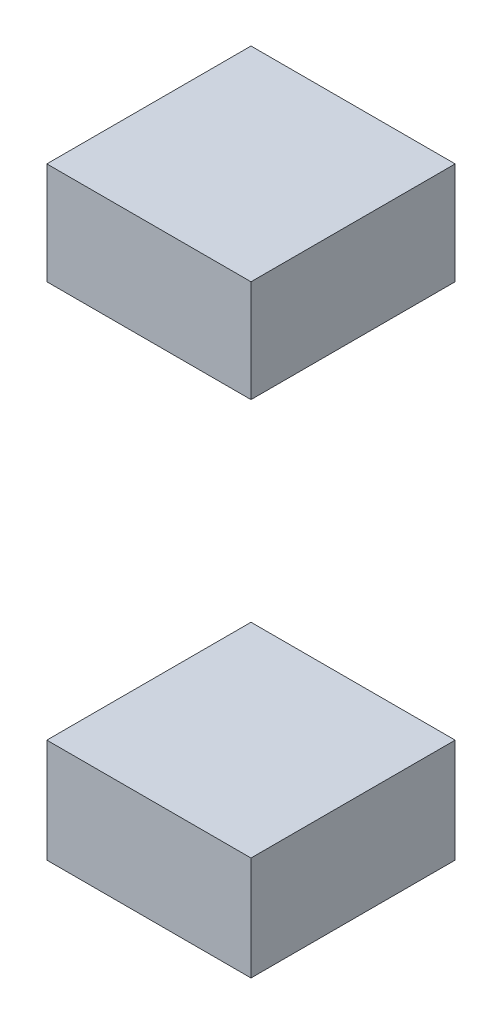
ISO-10303-21;
HEADER;
FILE_DESCRIPTION(('STEP AP214'),'2;1');
FILE_NAME('part.step','',(''),(''),'','','');
FILE_SCHEMA(('AUTOMOTIVE_DESIGN { 1 0 10303 214 1 1 1 1 }'));
ENDSEC;
DATA;
#1=APPLICATION_CONTEXT('core data for automotive mechanical design processes');
#2=APPLICATION_PROTOCOL_DEFINITION('international standard','automotive_design',2000,#1);
#3=PRODUCT_CONTEXT('',#1,'mechanical');
#4=PRODUCT('Part','Part','',(#3));
#5=PRODUCT_RELATED_PRODUCT_CATEGORY('part','',(#4));
#6=PRODUCT_DEFINITION_FORMATION('','',#4);
#7=PRODUCT_DEFINITION_CONTEXT('part definition',#1,'design');
#8=PRODUCT_DEFINITION('design','',#6,#7);
#9=PRODUCT_DEFINITION_SHAPE('','',#8);
#10=(LENGTH_UNIT() NAMED_UNIT(*) SI_UNIT(.MILLI.,.METRE.));
#11=(NAMED_UNIT(*) PLANE_ANGLE_UNIT() SI_UNIT($,.RADIAN.));
#12=(NAMED_UNIT(*) SI_UNIT($,.STERADIAN.) SOLID_ANGLE_UNIT());
#13=UNCERTAINTY_MEASURE_WITH_UNIT(LENGTH_MEASURE(1.E-05),#10,'distance_accuracy_value','');
#14=(GEOMETRIC_REPRESENTATION_CONTEXT(3) GLOBAL_UNCERTAINTY_ASSIGNED_CONTEXT((#13)) GLOBAL_UNIT_ASSIGNED_CONTEXT((#10,
#11,#12)) REPRESENTATION_CONTEXT('',''));
#15=CARTESIAN_POINT('',(0.,0.,0.));
#16=DIRECTION('',(0.,0.,1.));
#17=DIRECTION('',(1.,0.,0.));
#18=AXIS2_PLACEMENT_3D('',#15,#16,#17);
#19=CARTESIAN_POINT('',(8.50000012665987,8.75000013038516,2.));
#20=DIRECTION('',(0.,0.,1.));
#21=DIRECTION('',(1.,0.,0.));
#22=AXIS2_PLACEMENT_3D('',#19,#20,#21);
#23=PLANE('',#22);
#24=DIRECTION('',(0.,1.,0.));
#25=VECTOR('',#24,1.);
#26=CARTESIAN_POINT('',(8.00000011920929,8.50000012665987,2.));
#27=LINE('',#26,#25);
#28=CARTESIAN_POINT('',(8.00000011920929,8.50000012665987,2.));
#29=VERTEX_POINT('',#28);
#30=CARTESIAN_POINT('',(8.00000011920929,9.00000013411045,2.));
#31=VERTEX_POINT('',#30);
#32=EDGE_CURVE('P0_E28',#29,#31,#27,.T.);
#33=ORIENTED_EDGE('',*,*,#32,.T.);
#34=DIRECTION('',(1.,0.,0.));
#35=VECTOR('',#34,1.);
#36=CARTESIAN_POINT('',(8.00000011920929,9.00000013411045,2.));
#37=LINE('',#36,#35);
#38=CARTESIAN_POINT('',(9.00000013411045,9.00000013411045,2.));
#39=VERTEX_POINT('',#38);
#40=EDGE_CURVE('P0_E91',#31,#39,#37,.T.);
#41=ORIENTED_EDGE('',*,*,#40,.T.);
#42=DIRECTION('',(0.,-1.,0.));
#43=VECTOR('',#42,1.);
#44=CARTESIAN_POINT('',(9.00000013411045,9.00000013411045,2.));
#45=LINE('',#44,#43);
#46=CARTESIAN_POINT('',(9.00000013411045,8.50000012665987,2.));
#47=VERTEX_POINT('',#46);
#48=EDGE_CURVE('P0_E71',#39,#47,#45,.T.);
#49=ORIENTED_EDGE('',*,*,#48,.T.);
#50=DIRECTION('',(1.,0.,0.));
#51=VECTOR('',#50,1.);
#52=CARTESIAN_POINT('',(8.00000011920929,8.50000012665987,2.));
#53=LINE('',#52,#51);
#54=EDGE_CURVE('P0_E102',#29,#47,#53,.T.);
#55=ORIENTED_EDGE('',*,*,#54,.F.);
#56=EDGE_LOOP('',(#33,#41,#49,#55));
#57=FACE_BOUND('',#56,.T.);
#58=ADVANCED_FACE('P0_F17',(#57),#23,.F.);
#59=CARTESIAN_POINT('',(8.50000012665987,8.75000013038516,3.));
#60=DIRECTION('',(0.,0.,1.));
#61=DIRECTION('',(1.,0.,0.));
#62=AXIS2_PLACEMENT_3D('',#59,#60,#61);
#63=PLANE('',#62);
#64=DIRECTION('',(0.,-1.,0.));
#65=VECTOR('',#64,1.);
#66=CARTESIAN_POINT('',(8.00000011920929,8.50000012665987,3.));
#67=LINE('',#66,#65);
#68=CARTESIAN_POINT('',(8.00000011920929,9.00000013411045,3.));
#69=VERTEX_POINT('',#68);
#70=CARTESIAN_POINT('',(8.00000011920929,8.50000012665987,3.));
#71=VERTEX_POINT('',#70);
#72=EDGE_CURVE('P0_E11',#69,#71,#67,.T.);
#73=ORIENTED_EDGE('',*,*,#72,.T.);
#74=DIRECTION('',(1.,0.,0.));
#75=VECTOR('',#74,1.);
#76=CARTESIAN_POINT('',(8.00000011920929,8.50000012665987,3.));
#77=LINE('',#76,#75);
#78=CARTESIAN_POINT('',(9.00000013411045,8.50000012665987,3.));
#79=VERTEX_POINT('',#78);
#80=EDGE_CURVE('P0_E100',#71,#79,#77,.T.);
#81=ORIENTED_EDGE('',*,*,#80,.T.);
#82=DIRECTION('',(0.,1.,0.));
#83=VECTOR('',#82,1.);
#84=CARTESIAN_POINT('',(9.00000013411045,9.00000013411045,3.));
#85=LINE('',#84,#83);
#86=CARTESIAN_POINT('',(9.00000013411045,9.00000013411045,3.));
#87=VERTEX_POINT('',#86);
#88=EDGE_CURVE('P0_E21',#79,#87,#85,.T.);
#89=ORIENTED_EDGE('',*,*,#88,.T.);
#90=DIRECTION('',(-1.,0.,0.));
#91=VECTOR('',#90,1.);
#92=CARTESIAN_POINT('',(8.00000011920929,9.00000013411045,3.));
#93=LINE('',#92,#91);
#94=EDGE_CURVE('P0_E84',#87,#69,#93,.T.);
#95=ORIENTED_EDGE('',*,*,#94,.T.);
#96=EDGE_LOOP('',(#73,#81,#89,#95));
#97=FACE_BOUND('',#96,.T.);
#98=ADVANCED_FACE('P0_F19',(#97),#63,.T.);
#99=CARTESIAN_POINT('',(8.00000011920929,9.00000013411045,2.));
#100=DIRECTION('',(-1.,0.,0.));
#101=DIRECTION('',(0.,0.,1.));
#102=AXIS2_PLACEMENT_3D('',#99,#100,#101);
#103=PLANE('',#102);
#104=ORIENTED_EDGE('',*,*,#32,.F.);
#105=DIRECTION('',(0.,0.,1.));
#106=VECTOR('',#105,1.);
#107=CARTESIAN_POINT('',(8.00000011920929,8.50000012665987,2.));
#108=LINE('',#107,#106);
#109=EDGE_CURVE('P0_E81',#29,#71,#108,.T.);
#110=ORIENTED_EDGE('',*,*,#109,.T.);
#111=ORIENTED_EDGE('',*,*,#72,.F.);
#112=DIRECTION('',(0.,0.,1.));
#113=VECTOR('',#112,1.);
#114=CARTESIAN_POINT('',(8.00000011920929,9.00000013411045,2.));
#115=LINE('',#114,#113);
#116=EDGE_CURVE('P0_E78',#31,#69,#115,.T.);
#117=ORIENTED_EDGE('',*,*,#116,.F.);
#118=EDGE_LOOP('',(#104,#110,#111,#117));
#119=FACE_BOUND('',#118,.T.);
#120=ADVANCED_FACE('P0_F76',(#119),#103,.T.);
#121=CARTESIAN_POINT('',(8.00000011920929,8.50000012665987,2.));
#122=DIRECTION('',(0.,-1.,0.));
#123=DIRECTION('',(0.,0.,-1.));
#124=AXIS2_PLACEMENT_3D('',#121,#122,#123);
#125=PLANE('',#124);
#126=ORIENTED_EDGE('',*,*,#54,.T.);
#127=DIRECTION('',(0.,0.,1.));
#128=VECTOR('',#127,1.);
#129=CARTESIAN_POINT('',(9.00000013411045,8.50000012665987,2.));
#130=LINE('',#129,#128);
#131=EDGE_CURVE('P0_E104',#47,#79,#130,.T.);
#132=ORIENTED_EDGE('',*,*,#131,.T.);
#133=ORIENTED_EDGE('',*,*,#80,.F.);
#134=ORIENTED_EDGE('',*,*,#109,.F.);
#135=EDGE_LOOP('',(#126,#132,#133,#134));
#136=FACE_BOUND('',#135,.T.);
#137=ADVANCED_FACE('P0_F144',(#136),#125,.T.);
#138=CARTESIAN_POINT('',(9.00000013411045,8.50000012665987,2.));
#139=DIRECTION('',(1.,0.,0.));
#140=DIRECTION('',(0.,1.,0.));
#141=AXIS2_PLACEMENT_3D('',#138,#139,#140);
#142=PLANE('',#141);
#143=ORIENTED_EDGE('',*,*,#48,.F.);
#144=DIRECTION('',(0.,0.,1.));
#145=VECTOR('',#144,1.);
#146=CARTESIAN_POINT('',(9.00000013411045,9.00000013411045,2.));
#147=LINE('',#146,#145);
#148=EDGE_CURVE('P0_E88',#39,#87,#147,.T.);
#149=ORIENTED_EDGE('',*,*,#148,.T.);
#150=ORIENTED_EDGE('',*,*,#88,.F.);
#151=ORIENTED_EDGE('',*,*,#131,.F.);
#152=EDGE_LOOP('',(#143,#149,#150,#151));
#153=FACE_BOUND('',#152,.T.);
#154=ADVANCED_FACE('P0_F120',(#153),#142,.T.);
#155=CARTESIAN_POINT('',(9.00000013411045,9.00000013411045,2.));
#156=DIRECTION('',(0.,1.,0.));
#157=DIRECTION('',(1.,0.,0.));
#158=AXIS2_PLACEMENT_3D('',#155,#156,#157);
#159=PLANE('',#158);
#160=ORIENTED_EDGE('',*,*,#40,.F.);
#161=ORIENTED_EDGE('',*,*,#116,.T.);
#162=ORIENTED_EDGE('',*,*,#94,.F.);
#163=ORIENTED_EDGE('',*,*,#148,.F.);
#164=EDGE_LOOP('',(#160,#161,#162,#163));
#165=FACE_BOUND('',#164,.T.);
#166=ADVANCED_FACE('P0_F90',(#165),#159,.T.);
#167=CLOSED_SHELL('',(#58,#98,#120,#137,#154,#166));
#168=MANIFOLD_SOLID_BREP('P0_B1',#167);
#169=CARTESIAN_POINT('',(8.50000012665987,6.30136829700765,2.));
#170=DIRECTION('',(0.,0.,1.));
#171=DIRECTION('',(1.,0.,0.));
#172=AXIS2_PLACEMENT_3D('',#169,#170,#171);
#173=PLANE('',#172);
#174=DIRECTION('',(0.,-1.,0.));
#175=VECTOR('',#174,1.);
#176=CARTESIAN_POINT('',(9.00000013411045,6.55586150390983,2.));
#177=LINE('',#176,#175);
#178=CARTESIAN_POINT('',(9.00000013411045,6.55586150390983,2.));
#179=VERTEX_POINT('',#178);
#180=CARTESIAN_POINT('',(9.00000013411045,6.04687509010546,2.));
#181=VERTEX_POINT('',#180);
#182=EDGE_CURVE('P1_E27',#179,#181,#177,.T.);
#183=ORIENTED_EDGE('',*,*,#182,.T.);
#184=DIRECTION('',(-1.,0.,0.));
#185=VECTOR('',#184,1.);
#186=CARTESIAN_POINT('',(9.00000013411045,6.04687509010546,2.));
#187=LINE('',#186,#185);
#188=CARTESIAN_POINT('',(8.00000011920929,6.04687509010546,2.));
#189=VERTEX_POINT('',#188);
#190=EDGE_CURVE('P1_E21',#181,#189,#187,.T.);
#191=ORIENTED_EDGE('',*,*,#190,.T.);
#192=DIRECTION('',(0.,1.,0.));
#193=VECTOR('',#192,1.);
#194=CARTESIAN_POINT('',(8.00000011920929,6.04687509010546,2.));
#195=LINE('',#194,#193);
#196=CARTESIAN_POINT('',(8.00000011920929,6.55586150390983,2.));
#197=VERTEX_POINT('',#196);
#198=EDGE_CURVE('P1_E72',#189,#197,#195,.T.);
#199=ORIENTED_EDGE('',*,*,#198,.T.);
#200=DIRECTION('',(-1.,0.,0.));
#201=VECTOR('',#200,1.);
#202=CARTESIAN_POINT('',(9.00000013411045,6.55586150390983,2.));
#203=LINE('',#202,#201);
#204=EDGE_CURVE('P1_E110',#179,#197,#203,.T.);
#205=ORIENTED_EDGE('',*,*,#204,.F.);
#206=EDGE_LOOP('',(#183,#191,#199,#205));
#207=FACE_BOUND('',#206,.T.);
#208=ADVANCED_FACE('P1_F17',(#207),#173,.F.);
#209=CARTESIAN_POINT('',(8.50000012665987,6.30136829700765,3.));
#210=DIRECTION('',(0.,0.,1.));
#211=DIRECTION('',(1.,0.,0.));
#212=AXIS2_PLACEMENT_3D('',#209,#210,#211);
#213=PLANE('',#212);
#214=DIRECTION('',(0.,1.,0.));
#215=VECTOR('',#214,1.);
#216=CARTESIAN_POINT('',(9.00000013411045,6.55586150390983,3.));
#217=LINE('',#216,#215);
#218=CARTESIAN_POINT('',(9.00000013411045,6.04687509010546,3.));
#219=VERTEX_POINT('',#218);
#220=CARTESIAN_POINT('',(9.00000013411045,6.55586150390983,3.));
#221=VERTEX_POINT('',#220);
#222=EDGE_CURVE('P1_E11',#219,#221,#217,.T.);
#223=ORIENTED_EDGE('',*,*,#222,.T.);
#224=DIRECTION('',(-1.,0.,0.));
#225=VECTOR('',#224,1.);
#226=CARTESIAN_POINT('',(9.00000013411045,6.55586150390983,3.));
#227=LINE('',#226,#225);
#228=CARTESIAN_POINT('',(8.00000011920929,6.55586150390983,3.));
#229=VERTEX_POINT('',#228);
#230=EDGE_CURVE('P1_E86',#221,#229,#227,.T.);
#231=ORIENTED_EDGE('',*,*,#230,.T.);
#232=DIRECTION('',(0.,-1.,0.));
#233=VECTOR('',#232,1.);
#234=CARTESIAN_POINT('',(8.00000011920929,6.04687509010546,3.));
#235=LINE('',#234,#233);
#236=CARTESIAN_POINT('',(8.00000011920929,6.04687509010546,3.));
#237=VERTEX_POINT('',#236);
#238=EDGE_CURVE('P1_E81',#229,#237,#235,.T.);
#239=ORIENTED_EDGE('',*,*,#238,.T.);
#240=DIRECTION('',(1.,0.,0.));
#241=VECTOR('',#240,1.);
#242=CARTESIAN_POINT('',(9.00000013411045,6.04687509010546,3.));
#243=LINE('',#242,#241);
#244=EDGE_CURVE('P1_E83',#237,#219,#243,.T.);
#245=ORIENTED_EDGE('',*,*,#244,.T.);
#246=EDGE_LOOP('',(#223,#231,#239,#245));
#247=FACE_BOUND('',#246,.T.);
#248=ADVANCED_FACE('P1_F19',(#247),#213,.T.);
#249=CARTESIAN_POINT('',(9.00000013411045,6.04687509010546,2.));
#250=DIRECTION('',(1.,0.,0.));
#251=DIRECTION('',(0.,1.,0.));
#252=AXIS2_PLACEMENT_3D('',#249,#250,#251);
#253=PLANE('',#252);
#254=ORIENTED_EDGE('',*,*,#182,.F.);
#255=DIRECTION('',(0.,0.,1.));
#256=VECTOR('',#255,1.);
#257=CARTESIAN_POINT('',(9.00000013411045,6.55586150390983,2.));
#258=LINE('',#257,#256);
#259=EDGE_CURVE('P1_E107',#179,#221,#258,.T.);
#260=ORIENTED_EDGE('',*,*,#259,.T.);
#261=ORIENTED_EDGE('',*,*,#222,.F.);
#262=DIRECTION('',(0.,0.,1.));
#263=VECTOR('',#262,1.);
#264=CARTESIAN_POINT('',(9.00000013411045,6.04687509010546,2.));
#265=LINE('',#264,#263);
#266=EDGE_CURVE('P1_E98',#181,#219,#265,.T.);
#267=ORIENTED_EDGE('',*,*,#266,.F.);
#268=EDGE_LOOP('',(#254,#260,#261,#267));
#269=FACE_BOUND('',#268,.T.);
#270=ADVANCED_FACE('P1_F135',(#269),#253,.T.);
#271=CARTESIAN_POINT('',(9.00000013411045,6.55586150390983,2.));
#272=DIRECTION('',(0.,1.,0.));
#273=DIRECTION('',(1.,0.,0.));
#274=AXIS2_PLACEMENT_3D('',#271,#272,#273);
#275=PLANE('',#274);
#276=ORIENTED_EDGE('',*,*,#204,.T.);
#277=DIRECTION('',(0.,0.,1.));
#278=VECTOR('',#277,1.);
#279=CARTESIAN_POINT('',(8.00000011920929,6.55586150390983,2.));
#280=LINE('',#279,#278);
#281=EDGE_CURVE('P1_E89',#197,#229,#280,.T.);
#282=ORIENTED_EDGE('',*,*,#281,.T.);
#283=ORIENTED_EDGE('',*,*,#230,.F.);
#284=ORIENTED_EDGE('',*,*,#259,.F.);
#285=EDGE_LOOP('',(#276,#282,#283,#284));
#286=FACE_BOUND('',#285,.T.);
#287=ADVANCED_FACE('P1_F120',(#286),#275,.T.);
#288=CARTESIAN_POINT('',(8.00000011920929,6.55586150390983,2.));
#289=DIRECTION('',(-1.,0.,0.));
#290=DIRECTION('',(0.,0.,1.));
#291=AXIS2_PLACEMENT_3D('',#288,#289,#290);
#292=PLANE('',#291);
#293=ORIENTED_EDGE('',*,*,#198,.F.);
#294=DIRECTION('',(0.,0.,1.));
#295=VECTOR('',#294,1.);
#296=CARTESIAN_POINT('',(8.00000011920929,6.04687509010546,2.));
#297=LINE('',#296,#295);
#298=EDGE_CURVE('P1_E91',#189,#237,#297,.T.);
#299=ORIENTED_EDGE('',*,*,#298,.T.);
#300=ORIENTED_EDGE('',*,*,#238,.F.);
#301=ORIENTED_EDGE('',*,*,#281,.F.);
#302=EDGE_LOOP('',(#293,#299,#300,#301));
#303=FACE_BOUND('',#302,.T.);
#304=ADVANCED_FACE('P1_F92',(#303),#292,.T.);
#305=CARTESIAN_POINT('',(8.00000011920929,6.04687509010546,2.));
#306=DIRECTION('',(0.,-1.,0.));
#307=DIRECTION('',(0.,0.,-1.));
#308=AXIS2_PLACEMENT_3D('',#305,#306,#307);
#309=PLANE('',#308);
#310=ORIENTED_EDGE('',*,*,#190,.F.);
#311=ORIENTED_EDGE('',*,*,#266,.T.);
#312=ORIENTED_EDGE('',*,*,#244,.F.);
#313=ORIENTED_EDGE('',*,*,#298,.F.);
#314=EDGE_LOOP('',(#310,#311,#312,#313));
#315=FACE_BOUND('',#314,.T.);
#316=ADVANCED_FACE('P1_F97',(#315),#309,.T.);
#317=CLOSED_SHELL('',(#208,#248,#270,#287,#304,#316));
#318=MANIFOLD_SOLID_BREP('P1_B1',#317);
#319=ADVANCED_BREP_SHAPE_REPRESENTATION('',(#18,#168,#318),#14);
#320=SHAPE_DEFINITION_REPRESENTATION(#9,#319);
ENDSEC;
END-ISO-10303-21;
